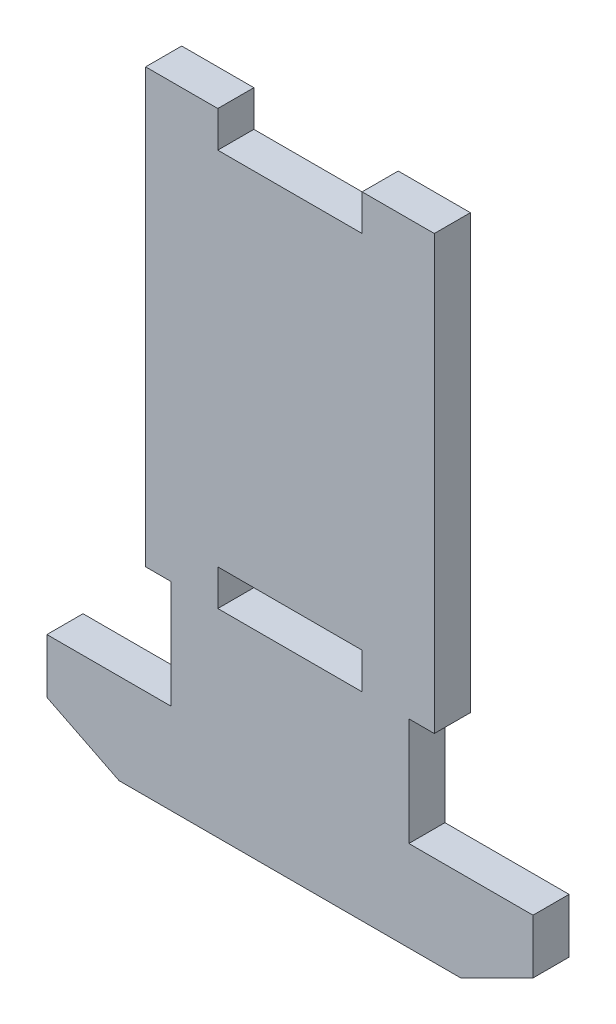
ISO-10303-21;
HEADER;
FILE_DESCRIPTION(('STEP AP214'),'2;1');
FILE_NAME('part.step','',(''),(''),'','','');
FILE_SCHEMA(('AUTOMOTIVE_DESIGN { 1 0 10303 214 1 1 1 1 }'));
ENDSEC;
DATA;
#1=APPLICATION_CONTEXT('core data for automotive mechanical design processes');
#2=APPLICATION_PROTOCOL_DEFINITION('international standard','automotive_design',2000,#1);
#3=PRODUCT_CONTEXT('',#1,'mechanical');
#4=PRODUCT('Part','Part','',(#3));
#5=PRODUCT_RELATED_PRODUCT_CATEGORY('part','',(#4));
#6=PRODUCT_DEFINITION_FORMATION('','',#4);
#7=PRODUCT_DEFINITION_CONTEXT('part definition',#1,'design');
#8=PRODUCT_DEFINITION('design','',#6,#7);
#9=PRODUCT_DEFINITION_SHAPE('','',#8);
#10=(LENGTH_UNIT() NAMED_UNIT(*) SI_UNIT(.MILLI.,.METRE.));
#11=(NAMED_UNIT(*) PLANE_ANGLE_UNIT() SI_UNIT($,.RADIAN.));
#12=(NAMED_UNIT(*) SI_UNIT($,.STERADIAN.) SOLID_ANGLE_UNIT());
#13=UNCERTAINTY_MEASURE_WITH_UNIT(LENGTH_MEASURE(1.E-05),#10,'distance_accuracy_value','');
#14=(GEOMETRIC_REPRESENTATION_CONTEXT(3) GLOBAL_UNCERTAINTY_ASSIGNED_CONTEXT((#13)) GLOBAL_UNIT_ASSIGNED_CONTEXT((#10,
#11,#12)) REPRESENTATION_CONTEXT('',''));
#15=CARTESIAN_POINT('',(0.,0.,0.));
#16=DIRECTION('',(0.,0.,1.));
#17=DIRECTION('',(1.,0.,0.));
#18=AXIS2_PLACEMENT_3D('',#15,#16,#17);
#19=CARTESIAN_POINT('',(12.7,-19.05,3.175));
#20=DIRECTION('',(0.,0.,-1.));
#21=DIRECTION('',(-1.,0.,0.));
#22=AXIS2_PLACEMENT_3D('',#19,#20,#21);
#23=PLANE('',#22);
#24=DIRECTION('',(0.,-1.,0.));
#25=VECTOR('',#24,1.);
#26=CARTESIAN_POINT('',(6.35,-19.05,3.175));
#27=LINE('',#26,#25);
#28=CARTESIAN_POINT('',(6.35,-15.875,3.175));
#29=VERTEX_POINT('',#28);
#30=CARTESIAN_POINT('',(6.35,-19.05,3.175));
#31=VERTEX_POINT('',#30);
#32=EDGE_CURVE('E305',#29,#31,#27,.T.);
#33=ORIENTED_EDGE('',*,*,#32,.T.);
#34=DIRECTION('',(1.,0.,0.));
#35=VECTOR('',#34,1.);
#36=CARTESIAN_POINT('',(12.7,-19.05,3.175));
#37=LINE('',#36,#35);
#38=CARTESIAN_POINT('',(-6.35,-19.05,3.175));
#39=VERTEX_POINT('',#38);
#40=EDGE_CURVE('E275',#39,#31,#37,.T.);
#41=ORIENTED_EDGE('',*,*,#40,.F.);
#42=DIRECTION('',(0.,1.,0.));
#43=VECTOR('',#42,1.);
#44=CARTESIAN_POINT('',(-6.35,-19.05,3.175));
#45=LINE('',#44,#43);
#46=CARTESIAN_POINT('',(-6.35,-15.875,3.175));
#47=VERTEX_POINT('',#46);
#48=EDGE_CURVE('E301',#39,#47,#45,.T.);
#49=ORIENTED_EDGE('',*,*,#48,.T.);
#50=DIRECTION('',(1.,0.,0.));
#51=VECTOR('',#50,1.);
#52=CARTESIAN_POINT('',(-6.35,-15.875,3.175));
#53=LINE('',#52,#51);
#54=EDGE_CURVE('E303',#47,#29,#53,.T.);
#55=ORIENTED_EDGE('',*,*,#54,.T.);
#56=EDGE_LOOP('',(#33,#41,#49,#55));
#57=FACE_BOUND('',#56,.T.);
#58=DIRECTION('',(0.894427190999916,-0.447213595499958,0.));
#59=VECTOR('',#58,1.);
#60=CARTESIAN_POINT('',(-21.38426,-33.3375,3.175));
#61=LINE('',#60,#59);
#62=CARTESIAN_POINT('',(-21.38426,-33.3375,3.175));
#63=VERTEX_POINT('',#62);
#64=CARTESIAN_POINT('',(-15.03426,-36.5125,3.175));
#65=VERTEX_POINT('',#64);
#66=EDGE_CURVE('E50',#63,#65,#61,.T.);
#67=ORIENTED_EDGE('',*,*,#66,.T.);
#68=DIRECTION('',(1.,0.,0.));
#69=VECTOR('',#68,1.);
#70=CARTESIAN_POINT('',(12.7,-36.5125,3.175));
#71=LINE('',#70,#69);
#72=CARTESIAN_POINT('',(15.03426,-36.5125,3.175));
#73=VERTEX_POINT('',#72);
#74=EDGE_CURVE('E278',#65,#73,#71,.T.);
#75=ORIENTED_EDGE('',*,*,#74,.T.);
#76=DIRECTION('',(-0.894427190999916,-0.447213595499958,0.));
#77=VECTOR('',#76,1.);
#78=CARTESIAN_POINT('',(21.38426,-33.3375,3.175));
#79=LINE('',#78,#77);
#80=CARTESIAN_POINT('',(21.38426,-33.3375,3.175));
#81=VERTEX_POINT('',#80);
#82=EDGE_CURVE('E233',#81,#73,#79,.T.);
#83=ORIENTED_EDGE('',*,*,#82,.F.);
#84=DIRECTION('',(0.,1.,0.));
#85=VECTOR('',#84,1.);
#86=CARTESIAN_POINT('',(21.38426,-28.55,3.175));
#87=LINE('',#86,#85);
#88=CARTESIAN_POINT('',(21.38426,-28.55,3.175));
#89=VERTEX_POINT('',#88);
#90=EDGE_CURVE('E244',#81,#89,#87,.T.);
#91=ORIENTED_EDGE('',*,*,#90,.T.);
#92=DIRECTION('',(1.,0.,0.));
#93=VECTOR('',#92,1.);
#94=CARTESIAN_POINT('',(12.7,-28.55,3.175));
#95=LINE('',#94,#93);
#96=CARTESIAN_POINT('',(10.461999904,-28.55,3.175));
#97=VERTEX_POINT('',#96);
#98=EDGE_CURVE('E269',#97,#89,#95,.T.);
#99=ORIENTED_EDGE('',*,*,#98,.F.);
#100=DIRECTION('',(0.,-1.,0.));
#101=VECTOR('',#100,1.);
#102=CARTESIAN_POINT('',(10.461999904,-19.05,3.175));
#103=LINE('',#102,#101);
#104=CARTESIAN_POINT('',(10.461999904,-19.05,3.175));
#105=VERTEX_POINT('',#104);
#106=EDGE_CURVE('E246',#105,#97,#103,.T.);
#107=ORIENTED_EDGE('',*,*,#106,.F.);
#108=DIRECTION('',(-1.,0.,0.));
#109=VECTOR('',#108,1.);
#110=CARTESIAN_POINT('',(12.7,-19.05,3.175));
#111=LINE('',#110,#109);
#112=CARTESIAN_POINT('',(12.7,-19.05,3.175));
#113=VERTEX_POINT('',#112);
#114=EDGE_CURVE('E254',#113,#105,#111,.T.);
#115=ORIENTED_EDGE('',*,*,#114,.F.);
#116=DIRECTION('',(0.,1.,0.));
#117=VECTOR('',#116,1.);
#118=CARTESIAN_POINT('',(12.7,19.05,3.175));
#119=LINE('',#118,#117);
#120=CARTESIAN_POINT('',(12.7,19.05,3.175));
#121=VERTEX_POINT('',#120);
#122=EDGE_CURVE('E285',#113,#121,#119,.T.);
#123=ORIENTED_EDGE('',*,*,#122,.T.);
#124=DIRECTION('',(-1.,0.,0.));
#125=VECTOR('',#124,1.);
#126=CARTESIAN_POINT('',(6.35,19.05,3.175));
#127=LINE('',#126,#125);
#128=CARTESIAN_POINT('',(6.35,19.05,3.175));
#129=VERTEX_POINT('',#128);
#130=EDGE_CURVE('E287',#121,#129,#127,.T.);
#131=ORIENTED_EDGE('',*,*,#130,.T.);
#132=DIRECTION('',(0.,-1.,0.));
#133=VECTOR('',#132,1.);
#134=CARTESIAN_POINT('',(6.35,19.05,3.175));
#135=LINE('',#134,#133);
#136=CARTESIAN_POINT('',(6.35,15.875,3.175));
#137=VERTEX_POINT('',#136);
#138=EDGE_CURVE('E290',#129,#137,#135,.T.);
#139=ORIENTED_EDGE('',*,*,#138,.T.);
#140=DIRECTION('',(-1.,0.,0.));
#141=VECTOR('',#140,1.);
#142=CARTESIAN_POINT('',(-6.35,15.875,3.175));
#143=LINE('',#142,#141);
#144=CARTESIAN_POINT('',(-6.35,15.875,3.175));
#145=VERTEX_POINT('',#144);
#146=EDGE_CURVE('E292',#137,#145,#143,.T.);
#147=ORIENTED_EDGE('',*,*,#146,.T.);
#148=DIRECTION('',(0.,1.,0.));
#149=VECTOR('',#148,1.);
#150=CARTESIAN_POINT('',(-6.35,19.05,3.175));
#151=LINE('',#150,#149);
#152=CARTESIAN_POINT('',(-6.35,19.05,3.175));
#153=VERTEX_POINT('',#152);
#154=EDGE_CURVE('E294',#145,#153,#151,.T.);
#155=ORIENTED_EDGE('',*,*,#154,.T.);
#156=DIRECTION('',(-1.,0.,0.));
#157=VECTOR('',#156,1.);
#158=CARTESIAN_POINT('',(-12.7,19.05,3.175));
#159=LINE('',#158,#157);
#160=CARTESIAN_POINT('',(-12.7,19.05,3.175));
#161=VERTEX_POINT('',#160);
#162=EDGE_CURVE('E296',#153,#161,#159,.T.);
#163=ORIENTED_EDGE('',*,*,#162,.T.);
#164=DIRECTION('',(0.,-1.,0.));
#165=VECTOR('',#164,1.);
#166=CARTESIAN_POINT('',(-12.7,19.05,3.175));
#167=LINE('',#166,#165);
#168=CARTESIAN_POINT('',(-12.7,-19.05,3.175));
#169=VERTEX_POINT('',#168);
#170=EDGE_CURVE('E298',#161,#169,#167,.T.);
#171=ORIENTED_EDGE('',*,*,#170,.T.);
#172=DIRECTION('',(1.,0.,0.));
#173=VECTOR('',#172,1.);
#174=CARTESIAN_POINT('',(-12.7,-19.05,3.175));
#175=LINE('',#174,#173);
#176=CARTESIAN_POINT('',(-10.461999904,-19.05,3.175));
#177=VERTEX_POINT('',#176);
#178=EDGE_CURVE('E227',#169,#177,#175,.T.);
#179=ORIENTED_EDGE('',*,*,#178,.T.);
#180=DIRECTION('',(0.,-1.,0.));
#181=VECTOR('',#180,1.);
#182=CARTESIAN_POINT('',(-10.461999904,-19.05,3.175));
#183=LINE('',#182,#181);
#184=CARTESIAN_POINT('',(-10.461999904,-28.55,3.175));
#185=VERTEX_POINT('',#184);
#186=EDGE_CURVE('E212',#177,#185,#183,.T.);
#187=ORIENTED_EDGE('',*,*,#186,.T.);
#188=DIRECTION('',(-1.,0.,0.));
#189=VECTOR('',#188,1.);
#190=CARTESIAN_POINT('',(-12.7,-28.55,3.175));
#191=LINE('',#190,#189);
#192=CARTESIAN_POINT('',(-21.38426,-28.55,3.175));
#193=VERTEX_POINT('',#192);
#194=EDGE_CURVE('E215',#185,#193,#191,.T.);
#195=ORIENTED_EDGE('',*,*,#194,.T.);
#196=DIRECTION('',(0.,1.,0.));
#197=VECTOR('',#196,1.);
#198=CARTESIAN_POINT('',(-21.38426,-28.55,3.175));
#199=LINE('',#198,#197);
#200=EDGE_CURVE('E207',#63,#193,#199,.T.);
#201=ORIENTED_EDGE('',*,*,#200,.F.);
#202=EDGE_LOOP('',(#67,#75,#83,#91,#99,#107,#115,#123,#131,#139,#147,#155,#163,#171,#179,#187,
#195,#201));
#203=FACE_BOUND('',#202,.T.);
#204=ADVANCED_FACE('F35',(#57,#203),#23,.F.);
#205=CARTESIAN_POINT('',(12.7,-19.05,0.));
#206=DIRECTION('',(0.,0.,-1.));
#207=DIRECTION('',(-1.,0.,0.));
#208=AXIS2_PLACEMENT_3D('',#205,#206,#207);
#209=PLANE('',#208);
#210=DIRECTION('',(-1.,0.,0.));
#211=VECTOR('',#210,1.);
#212=CARTESIAN_POINT('',(12.7,-19.05,0.));
#213=LINE('',#212,#211);
#214=CARTESIAN_POINT('',(6.35,-19.05,0.));
#215=VERTEX_POINT('',#214);
#216=CARTESIAN_POINT('',(-6.35,-19.05,0.));
#217=VERTEX_POINT('',#216);
#218=EDGE_CURVE('E279',#215,#217,#213,.T.);
#219=ORIENTED_EDGE('',*,*,#218,.F.);
#220=DIRECTION('',(0.,-1.,0.));
#221=VECTOR('',#220,1.);
#222=CARTESIAN_POINT('',(6.35,-19.05,0.));
#223=LINE('',#222,#221);
#224=CARTESIAN_POINT('',(6.35,-15.875,0.));
#225=VERTEX_POINT('',#224);
#226=EDGE_CURVE('E288',#225,#215,#223,.T.);
#227=ORIENTED_EDGE('',*,*,#226,.F.);
#228=DIRECTION('',(1.,0.,0.));
#229=VECTOR('',#228,1.);
#230=CARTESIAN_POINT('',(-6.35,-15.875,0.));
#231=LINE('',#230,#229);
#232=CARTESIAN_POINT('',(-6.35,-15.875,0.));
#233=VERTEX_POINT('',#232);
#234=EDGE_CURVE('E324',#233,#225,#231,.T.);
#235=ORIENTED_EDGE('',*,*,#234,.F.);
#236=DIRECTION('',(0.,1.,0.));
#237=VECTOR('',#236,1.);
#238=CARTESIAN_POINT('',(-6.35,-19.05,0.));
#239=LINE('',#238,#237);
#240=EDGE_CURVE('E322',#217,#233,#239,.T.);
#241=ORIENTED_EDGE('',*,*,#240,.F.);
#242=EDGE_LOOP('',(#219,#227,#235,#241));
#243=FACE_BOUND('',#242,.T.);
#244=DIRECTION('',(-1.,0.,0.));
#245=VECTOR('',#244,1.);
#246=CARTESIAN_POINT('',(12.7,-36.5125,0.));
#247=LINE('',#246,#245);
#248=CARTESIAN_POINT('',(15.03426,-36.5125,0.));
#249=VERTEX_POINT('',#248);
#250=CARTESIAN_POINT('',(-15.03426,-36.5125,0.));
#251=VERTEX_POINT('',#250);
#252=EDGE_CURVE('E200',#249,#251,#247,.T.);
#253=ORIENTED_EDGE('',*,*,#252,.T.);
#254=DIRECTION('',(-0.894427190999916,0.447213595499958,0.));
#255=VECTOR('',#254,1.);
#256=CARTESIAN_POINT('',(-21.38426,-33.3375,0.));
#257=LINE('',#256,#255);
#258=CARTESIAN_POINT('',(-21.38426,-33.3375,0.));
#259=VERTEX_POINT('',#258);
#260=EDGE_CURVE('E185',#251,#259,#257,.T.);
#261=ORIENTED_EDGE('',*,*,#260,.T.);
#262=DIRECTION('',(0.,-1.,0.));
#263=VECTOR('',#262,1.);
#264=CARTESIAN_POINT('',(-21.38426,-28.55,0.));
#265=LINE('',#264,#263);
#266=CARTESIAN_POINT('',(-21.38426,-28.55,0.));
#267=VERTEX_POINT('',#266);
#268=EDGE_CURVE('E197',#267,#259,#265,.T.);
#269=ORIENTED_EDGE('',*,*,#268,.F.);
#270=DIRECTION('',(1.,0.,0.));
#271=VECTOR('',#270,1.);
#272=CARTESIAN_POINT('',(-12.7,-28.55,0.));
#273=LINE('',#272,#271);
#274=CARTESIAN_POINT('',(-10.461999904,-28.55,0.));
#275=VERTEX_POINT('',#274);
#276=EDGE_CURVE('E223',#267,#275,#273,.T.);
#277=ORIENTED_EDGE('',*,*,#276,.T.);
#278=DIRECTION('',(0.,1.,0.));
#279=VECTOR('',#278,1.);
#280=CARTESIAN_POINT('',(-10.461999904,-19.05,0.));
#281=LINE('',#280,#279);
#282=CARTESIAN_POINT('',(-10.461999904,-19.05,0.));
#283=VERTEX_POINT('',#282);
#284=EDGE_CURVE('E220',#275,#283,#281,.T.);
#285=ORIENTED_EDGE('',*,*,#284,.T.);
#286=DIRECTION('',(-1.,0.,0.));
#287=VECTOR('',#286,1.);
#288=CARTESIAN_POINT('',(-12.7,-19.05,0.));
#289=LINE('',#288,#287);
#290=CARTESIAN_POINT('',(-12.7,-19.05,0.));
#291=VERTEX_POINT('',#290);
#292=EDGE_CURVE('E218',#283,#291,#289,.T.);
#293=ORIENTED_EDGE('',*,*,#292,.T.);
#294=DIRECTION('',(0.,-1.,0.));
#295=VECTOR('',#294,1.);
#296=CARTESIAN_POINT('',(-12.7,19.05,0.));
#297=LINE('',#296,#295);
#298=CARTESIAN_POINT('',(-12.7,19.05,0.));
#299=VERTEX_POINT('',#298);
#300=EDGE_CURVE('E319',#299,#291,#297,.T.);
#301=ORIENTED_EDGE('',*,*,#300,.F.);
#302=DIRECTION('',(-1.,0.,0.));
#303=VECTOR('',#302,1.);
#304=CARTESIAN_POINT('',(-12.7,19.05,0.));
#305=LINE('',#304,#303);
#306=CARTESIAN_POINT('',(-6.35,19.05,0.));
#307=VERTEX_POINT('',#306);
#308=EDGE_CURVE('E317',#307,#299,#305,.T.);
#309=ORIENTED_EDGE('',*,*,#308,.F.);
#310=DIRECTION('',(0.,1.,0.));
#311=VECTOR('',#310,1.);
#312=CARTESIAN_POINT('',(-6.35,19.05,0.));
#313=LINE('',#312,#311);
#314=CARTESIAN_POINT('',(-6.35,15.875,0.));
#315=VERTEX_POINT('',#314);
#316=EDGE_CURVE('E315',#315,#307,#313,.T.);
#317=ORIENTED_EDGE('',*,*,#316,.F.);
#318=DIRECTION('',(-1.,0.,0.));
#319=VECTOR('',#318,1.);
#320=CARTESIAN_POINT('',(-6.35,15.875,0.));
#321=LINE('',#320,#319);
#322=CARTESIAN_POINT('',(6.35,15.875,0.));
#323=VERTEX_POINT('',#322);
#324=EDGE_CURVE('E313',#323,#315,#321,.T.);
#325=ORIENTED_EDGE('',*,*,#324,.F.);
#326=DIRECTION('',(0.,-1.,0.));
#327=VECTOR('',#326,1.);
#328=CARTESIAN_POINT('',(6.35,19.05,0.));
#329=LINE('',#328,#327);
#330=CARTESIAN_POINT('',(6.35,19.05,0.));
#331=VERTEX_POINT('',#330);
#332=EDGE_CURVE('E311',#331,#323,#329,.T.);
#333=ORIENTED_EDGE('',*,*,#332,.F.);
#334=DIRECTION('',(-1.,0.,0.));
#335=VECTOR('',#334,1.);
#336=CARTESIAN_POINT('',(6.35,19.05,0.));
#337=LINE('',#336,#335);
#338=CARTESIAN_POINT('',(12.7,19.05,0.));
#339=VERTEX_POINT('',#338);
#340=EDGE_CURVE('E309',#339,#331,#337,.T.);
#341=ORIENTED_EDGE('',*,*,#340,.F.);
#342=DIRECTION('',(0.,1.,0.));
#343=VECTOR('',#342,1.);
#344=CARTESIAN_POINT('',(12.7,19.05,0.));
#345=LINE('',#344,#343);
#346=CARTESIAN_POINT('',(12.7,-19.05,0.));
#347=VERTEX_POINT('',#346);
#348=EDGE_CURVE('E284',#347,#339,#345,.T.);
#349=ORIENTED_EDGE('',*,*,#348,.F.);
#350=DIRECTION('',(1.,0.,0.));
#351=VECTOR('',#350,1.);
#352=CARTESIAN_POINT('',(12.7,-19.05,0.));
#353=LINE('',#352,#351);
#354=CARTESIAN_POINT('',(10.461999904,-19.05,0.));
#355=VERTEX_POINT('',#354);
#356=EDGE_CURVE('E263',#355,#347,#353,.T.);
#357=ORIENTED_EDGE('',*,*,#356,.F.);
#358=DIRECTION('',(0.,1.,0.));
#359=VECTOR('',#358,1.);
#360=CARTESIAN_POINT('',(10.461999904,-19.05,0.));
#361=LINE('',#360,#359);
#362=CARTESIAN_POINT('',(10.461999904,-28.55,0.));
#363=VERTEX_POINT('',#362);
#364=EDGE_CURVE('E260',#363,#355,#361,.T.);
#365=ORIENTED_EDGE('',*,*,#364,.F.);
#366=DIRECTION('',(-1.,0.,0.));
#367=VECTOR('',#366,1.);
#368=CARTESIAN_POINT('',(12.7,-28.55,0.));
#369=LINE('',#368,#367);
#370=CARTESIAN_POINT('',(21.38426,-28.55,0.));
#371=VERTEX_POINT('',#370);
#372=EDGE_CURVE('E257',#371,#363,#369,.T.);
#373=ORIENTED_EDGE('',*,*,#372,.F.);
#374=DIRECTION('',(0.,-1.,0.));
#375=VECTOR('',#374,1.);
#376=CARTESIAN_POINT('',(21.38426,-28.55,0.));
#377=LINE('',#376,#375);
#378=CARTESIAN_POINT('',(21.38426,-33.3375,0.));
#379=VERTEX_POINT('',#378);
#380=EDGE_CURVE('E242',#371,#379,#377,.T.);
#381=ORIENTED_EDGE('',*,*,#380,.T.);
#382=DIRECTION('',(0.894427190999916,0.447213595499958,0.));
#383=VECTOR('',#382,1.);
#384=CARTESIAN_POINT('',(21.38426,-33.3375,0.));
#385=LINE('',#384,#383);
#386=EDGE_CURVE('E236',#249,#379,#385,.T.);
#387=ORIENTED_EDGE('',*,*,#386,.F.);
#388=EDGE_LOOP('',(#253,#261,#269,#277,#285,#293,#301,#309,#317,#325,#333,#341,#349,#357,#365,
#373,#381,#387));
#389=FACE_BOUND('',#388,.T.);
#390=ADVANCED_FACE('F195',(#243,#389),#209,.T.);
#391=CARTESIAN_POINT('',(12.7,-36.5125,33.9986744443293));
#392=DIRECTION('',(0.,-1.,0.));
#393=DIRECTION('',(0.,0.,-1.));
#394=AXIS2_PLACEMENT_3D('',#391,#392,#393);
#395=PLANE('',#394);
#396=ORIENTED_EDGE('',*,*,#74,.F.);
#397=DIRECTION('',(0.,0.,-1.));
#398=VECTOR('',#397,1.);
#399=CARTESIAN_POINT('',(-15.03426,-36.5125,3.176));
#400=LINE('',#399,#398);
#401=EDGE_CURVE('E190',#65,#251,#400,.T.);
#402=ORIENTED_EDGE('',*,*,#401,.T.);
#403=ORIENTED_EDGE('',*,*,#252,.F.);
#404=DIRECTION('',(0.,0.,-1.));
#405=VECTOR('',#404,1.);
#406=CARTESIAN_POINT('',(15.03426,-36.5125,3.176));
#407=LINE('',#406,#405);
#408=EDGE_CURVE('E238',#73,#249,#407,.T.);
#409=ORIENTED_EDGE('',*,*,#408,.F.);
#410=EDGE_LOOP('',(#396,#402,#403,#409));
#411=FACE_BOUND('',#410,.T.);
#412=ADVANCED_FACE('F400',(#411),#395,.T.);
#413=CARTESIAN_POINT('',(-21.38426,-28.55,14.9570956538979));
#414=DIRECTION('',(1.,0.,0.));
#415=DIRECTION('',(0.,0.,-1.));
#416=AXIS2_PLACEMENT_3D('',#413,#414,#415);
#417=PLANE('',#416);
#418=DIRECTION('',(0.,0.,-1.));
#419=VECTOR('',#418,1.);
#420=CARTESIAN_POINT('',(-21.38426,-33.3375,3.176));
#421=LINE('',#420,#419);
#422=EDGE_CURVE('E182',#63,#259,#421,.T.);
#423=ORIENTED_EDGE('',*,*,#422,.F.);
#424=ORIENTED_EDGE('',*,*,#200,.T.);
#425=DIRECTION('',(0.,0.,-1.));
#426=VECTOR('',#425,1.);
#427=CARTESIAN_POINT('',(-21.38426,-28.55,14.9570956538979));
#428=LINE('',#427,#426);
#429=EDGE_CURVE('E205',#193,#267,#428,.T.);
#430=ORIENTED_EDGE('',*,*,#429,.T.);
#431=ORIENTED_EDGE('',*,*,#268,.T.);
#432=EDGE_LOOP('',(#423,#424,#430,#431));
#433=FACE_BOUND('',#432,.T.);
#434=ADVANCED_FACE('F203',(#433),#417,.F.);
#435=CARTESIAN_POINT('',(-12.7,19.05,3.175));
#436=DIRECTION('',(1.,0.,0.));
#437=DIRECTION('',(0.,0.,-1.));
#438=AXIS2_PLACEMENT_3D('',#435,#436,#437);
#439=PLANE('',#438);
#440=DIRECTION('',(0.,0.,-1.));
#441=VECTOR('',#440,1.);
#442=CARTESIAN_POINT('',(-12.7,-19.05,3.176));
#443=LINE('',#442,#441);
#444=EDGE_CURVE('E58',#169,#291,#443,.T.);
#445=ORIENTED_EDGE('',*,*,#444,.F.);
#446=ORIENTED_EDGE('',*,*,#170,.F.);
#447=DIRECTION('',(0.,0.,-1.));
#448=VECTOR('',#447,1.);
#449=CARTESIAN_POINT('',(-12.7,19.05,3.175));
#450=LINE('',#449,#448);
#451=EDGE_CURVE('E338',#161,#299,#450,.T.);
#452=ORIENTED_EDGE('',*,*,#451,.T.);
#453=ORIENTED_EDGE('',*,*,#300,.T.);
#454=EDGE_LOOP('',(#445,#446,#452,#453));
#455=FACE_BOUND('',#454,.T.);
#456=ADVANCED_FACE('F408',(#455),#439,.F.);
#457=CARTESIAN_POINT('',(12.7,19.05,3.175));
#458=DIRECTION('',(-1.,0.,0.));
#459=DIRECTION('',(0.,0.,1.));
#460=AXIS2_PLACEMENT_3D('',#457,#458,#459);
#461=PLANE('',#460);
#462=ORIENTED_EDGE('',*,*,#122,.F.);
#463=DIRECTION('',(0.,0.,-1.));
#464=VECTOR('',#463,1.);
#465=CARTESIAN_POINT('',(12.7,-19.05,3.176));
#466=LINE('',#465,#464);
#467=EDGE_CURVE('E266',#113,#347,#466,.T.);
#468=ORIENTED_EDGE('',*,*,#467,.T.);
#469=ORIENTED_EDGE('',*,*,#348,.T.);
#470=DIRECTION('',(0.,0.,-1.));
#471=VECTOR('',#470,1.);
#472=CARTESIAN_POINT('',(12.7,19.05,3.175));
#473=LINE('',#472,#471);
#474=EDGE_CURVE('E11',#121,#339,#473,.T.);
#475=ORIENTED_EDGE('',*,*,#474,.F.);
#476=EDGE_LOOP('',(#462,#468,#469,#475));
#477=FACE_BOUND('',#476,.T.);
#478=ADVANCED_FACE('F37',(#477),#461,.F.);
#479=CARTESIAN_POINT('',(6.35,19.05,3.175));
#480=DIRECTION('',(0.,-1.,0.));
#481=DIRECTION('',(0.,0.,-1.));
#482=AXIS2_PLACEMENT_3D('',#479,#480,#481);
#483=PLANE('',#482);
#484=ORIENTED_EDGE('',*,*,#340,.T.);
#485=DIRECTION('',(0.,0.,-1.));
#486=VECTOR('',#485,1.);
#487=CARTESIAN_POINT('',(6.35,19.05,3.175));
#488=LINE('',#487,#486);
#489=EDGE_CURVE('E43',#129,#331,#488,.T.);
#490=ORIENTED_EDGE('',*,*,#489,.F.);
#491=ORIENTED_EDGE('',*,*,#130,.F.);
#492=ORIENTED_EDGE('',*,*,#474,.T.);
#493=EDGE_LOOP('',(#484,#490,#491,#492));
#494=FACE_BOUND('',#493,.T.);
#495=ADVANCED_FACE('F377',(#494),#483,.F.);
#496=CARTESIAN_POINT('',(6.35,19.05,3.175));
#497=DIRECTION('',(1.,0.,0.));
#498=DIRECTION('',(0.,1.,0.));
#499=AXIS2_PLACEMENT_3D('',#496,#497,#498);
#500=PLANE('',#499);
#501=ORIENTED_EDGE('',*,*,#332,.T.);
#502=DIRECTION('',(0.,0.,-1.));
#503=VECTOR('',#502,1.);
#504=CARTESIAN_POINT('',(6.35,15.875,3.175));
#505=LINE('',#504,#503);
#506=EDGE_CURVE('E347',#137,#323,#505,.T.);
#507=ORIENTED_EDGE('',*,*,#506,.F.);
#508=ORIENTED_EDGE('',*,*,#138,.F.);
#509=ORIENTED_EDGE('',*,*,#489,.T.);
#510=EDGE_LOOP('',(#501,#507,#508,#509));
#511=FACE_BOUND('',#510,.T.);
#512=ADVANCED_FACE('F354',(#511),#500,.F.);
#513=CARTESIAN_POINT('',(-6.35,15.875,3.175));
#514=DIRECTION('',(0.,-1.,0.));
#515=DIRECTION('',(0.,0.,-1.));
#516=AXIS2_PLACEMENT_3D('',#513,#514,#515);
#517=PLANE('',#516);
#518=ORIENTED_EDGE('',*,*,#324,.T.);
#519=DIRECTION('',(0.,0.,-1.));
#520=VECTOR('',#519,1.);
#521=CARTESIAN_POINT('',(-6.35,15.875,3.175));
#522=LINE('',#521,#520);
#523=EDGE_CURVE('E344',#145,#315,#522,.T.);
#524=ORIENTED_EDGE('',*,*,#523,.F.);
#525=ORIENTED_EDGE('',*,*,#146,.F.);
#526=ORIENTED_EDGE('',*,*,#506,.T.);
#527=EDGE_LOOP('',(#518,#524,#525,#526));
#528=FACE_BOUND('',#527,.T.);
#529=ADVANCED_FACE('F365',(#528),#517,.F.);
#530=CARTESIAN_POINT('',(-6.35,19.05,3.175));
#531=DIRECTION('',(-1.,0.,0.));
#532=DIRECTION('',(0.,0.,1.));
#533=AXIS2_PLACEMENT_3D('',#530,#531,#532);
#534=PLANE('',#533);
#535=ORIENTED_EDGE('',*,*,#316,.T.);
#536=DIRECTION('',(0.,0.,-1.));
#537=VECTOR('',#536,1.);
#538=CARTESIAN_POINT('',(-6.35,19.05,3.175));
#539=LINE('',#538,#537);
#540=EDGE_CURVE('E341',#153,#307,#539,.T.);
#541=ORIENTED_EDGE('',*,*,#540,.F.);
#542=ORIENTED_EDGE('',*,*,#154,.F.);
#543=ORIENTED_EDGE('',*,*,#523,.T.);
#544=EDGE_LOOP('',(#535,#541,#542,#543));
#545=FACE_BOUND('',#544,.T.);
#546=ADVANCED_FACE('F369',(#545),#534,.F.);
#547=CARTESIAN_POINT('',(-12.7,19.05,3.175));
#548=DIRECTION('',(0.,-1.,0.));
#549=DIRECTION('',(0.,0.,-1.));
#550=AXIS2_PLACEMENT_3D('',#547,#548,#549);
#551=PLANE('',#550);
#552=ORIENTED_EDGE('',*,*,#308,.T.);
#553=ORIENTED_EDGE('',*,*,#451,.F.);
#554=ORIENTED_EDGE('',*,*,#162,.F.);
#555=ORIENTED_EDGE('',*,*,#540,.T.);
#556=EDGE_LOOP('',(#552,#553,#554,#555));
#557=FACE_BOUND('',#556,.T.);
#558=ADVANCED_FACE('F431',(#557),#551,.F.);
#559=CARTESIAN_POINT('',(-6.35,-19.05,3.175));
#560=DIRECTION('',(-1.,0.,0.));
#561=DIRECTION('',(0.,-1.,0.));
#562=AXIS2_PLACEMENT_3D('',#559,#560,#561);
#563=PLANE('',#562);
#564=ORIENTED_EDGE('',*,*,#240,.T.);
#565=DIRECTION('',(0.,0.,-1.));
#566=VECTOR('',#565,1.);
#567=CARTESIAN_POINT('',(-6.35,-15.875,3.175));
#568=LINE('',#567,#566);
#569=EDGE_CURVE('E332',#47,#233,#568,.T.);
#570=ORIENTED_EDGE('',*,*,#569,.F.);
#571=ORIENTED_EDGE('',*,*,#48,.F.);
#572=DIRECTION('',(0.,0.,-1.));
#573=VECTOR('',#572,1.);
#574=CARTESIAN_POINT('',(-6.35,-19.05,3.175));
#575=LINE('',#574,#573);
#576=EDGE_CURVE('E335',#39,#217,#575,.T.);
#577=ORIENTED_EDGE('',*,*,#576,.T.);
#578=EDGE_LOOP('',(#564,#570,#571,#577));
#579=FACE_BOUND('',#578,.T.);
#580=ADVANCED_FACE('F427',(#579),#563,.F.);
#581=CARTESIAN_POINT('',(-6.35,-15.875,3.175));
#582=DIRECTION('',(0.,1.,0.));
#583=DIRECTION('',(0.,0.,1.));
#584=AXIS2_PLACEMENT_3D('',#581,#582,#583);
#585=PLANE('',#584);
#586=ORIENTED_EDGE('',*,*,#234,.T.);
#587=DIRECTION('',(0.,0.,-1.));
#588=VECTOR('',#587,1.);
#589=CARTESIAN_POINT('',(6.35,-15.875,3.175));
#590=LINE('',#589,#588);
#591=EDGE_CURVE('E329',#29,#225,#590,.T.);
#592=ORIENTED_EDGE('',*,*,#591,.F.);
#593=ORIENTED_EDGE('',*,*,#54,.F.);
#594=ORIENTED_EDGE('',*,*,#569,.T.);
#595=EDGE_LOOP('',(#586,#592,#593,#594));
#596=FACE_BOUND('',#595,.T.);
#597=ADVANCED_FACE('F423',(#596),#585,.F.);
#598=CARTESIAN_POINT('',(6.35,-19.05,3.175));
#599=DIRECTION('',(1.,0.,0.));
#600=DIRECTION('',(0.,1.,0.));
#601=AXIS2_PLACEMENT_3D('',#598,#599,#600);
#602=PLANE('',#601);
#603=ORIENTED_EDGE('',*,*,#226,.T.);
#604=DIRECTION('',(0.,0.,-1.));
#605=VECTOR('',#604,1.);
#606=CARTESIAN_POINT('',(6.35,-19.05,3.175));
#607=LINE('',#606,#605);
#608=EDGE_CURVE('E307',#31,#215,#607,.T.);
#609=ORIENTED_EDGE('',*,*,#608,.F.);
#610=ORIENTED_EDGE('',*,*,#32,.F.);
#611=ORIENTED_EDGE('',*,*,#591,.T.);
#612=EDGE_LOOP('',(#603,#609,#610,#611));
#613=FACE_BOUND('',#612,.T.);
#614=ADVANCED_FACE('F419',(#613),#602,.F.);
#615=CARTESIAN_POINT('',(12.7,-19.05,33.9986744443293));
#616=DIRECTION('',(0.,-1.,0.));
#617=DIRECTION('',(0.,0.,-1.));
#618=AXIS2_PLACEMENT_3D('',#615,#616,#617);
#619=PLANE('',#618);
#620=ORIENTED_EDGE('',*,*,#218,.T.);
#621=ORIENTED_EDGE('',*,*,#576,.F.);
#622=ORIENTED_EDGE('',*,*,#40,.T.);
#623=ORIENTED_EDGE('',*,*,#608,.T.);
#624=EDGE_LOOP('',(#620,#621,#622,#623));
#625=FACE_BOUND('',#624,.T.);
#626=ADVANCED_FACE('F422',(#625),#619,.F.);
#627=CARTESIAN_POINT('',(12.7,-19.05,3.176));
#628=DIRECTION('',(0.,1.,0.));
#629=DIRECTION('',(0.,0.,1.));
#630=AXIS2_PLACEMENT_3D('',#627,#628,#629);
#631=PLANE('',#630);
#632=ORIENTED_EDGE('',*,*,#114,.T.);
#633=DIRECTION('',(0.,0.,-1.));
#634=VECTOR('',#633,1.);
#635=CARTESIAN_POINT('',(10.461999904,-19.05,3.176));
#636=LINE('',#635,#634);
#637=EDGE_CURVE('E270',#105,#355,#636,.T.);
#638=ORIENTED_EDGE('',*,*,#637,.T.);
#639=ORIENTED_EDGE('',*,*,#356,.T.);
#640=ORIENTED_EDGE('',*,*,#467,.F.);
#641=EDGE_LOOP('',(#632,#638,#639,#640));
#642=FACE_BOUND('',#641,.T.);
#643=ADVANCED_FACE('F382',(#642),#631,.F.);
#644=CARTESIAN_POINT('',(10.461999904,-19.05,3.176));
#645=DIRECTION('',(-1.,0.,0.));
#646=DIRECTION('',(0.,-1.,0.));
#647=AXIS2_PLACEMENT_3D('',#644,#645,#646);
#648=PLANE('',#647);
#649=ORIENTED_EDGE('',*,*,#106,.T.);
#650=DIRECTION('',(0.,0.,-1.));
#651=VECTOR('',#650,1.);
#652=CARTESIAN_POINT('',(10.461999904,-28.55,3.176));
#653=LINE('',#652,#651);
#654=EDGE_CURVE('E265',#97,#363,#653,.T.);
#655=ORIENTED_EDGE('',*,*,#654,.T.);
#656=ORIENTED_EDGE('',*,*,#364,.T.);
#657=ORIENTED_EDGE('',*,*,#637,.F.);
#658=EDGE_LOOP('',(#649,#655,#656,#657));
#659=FACE_BOUND('',#658,.T.);
#660=ADVANCED_FACE('F385',(#659),#648,.F.);
#661=CARTESIAN_POINT('',(12.7,-28.55,3.176));
#662=DIRECTION('',(0.,-1.,0.));
#663=DIRECTION('',(0.,0.,-1.));
#664=AXIS2_PLACEMENT_3D('',#661,#662,#663);
#665=PLANE('',#664);
#666=ORIENTED_EDGE('',*,*,#98,.T.);
#667=DIRECTION('',(0.,0.,-1.));
#668=VECTOR('',#667,1.);
#669=CARTESIAN_POINT('',(21.38426,-28.55,14.9570956538979));
#670=LINE('',#669,#668);
#671=EDGE_CURVE('E247',#89,#371,#670,.T.);
#672=ORIENTED_EDGE('',*,*,#671,.T.);
#673=ORIENTED_EDGE('',*,*,#372,.T.);
#674=ORIENTED_EDGE('',*,*,#654,.F.);
#675=EDGE_LOOP('',(#666,#672,#673,#674));
#676=FACE_BOUND('',#675,.T.);
#677=ADVANCED_FACE('F388',(#676),#665,.F.);
#678=CARTESIAN_POINT('',(21.38426,-28.55,14.9570956538979));
#679=DIRECTION('',(1.,0.,0.));
#680=DIRECTION('',(0.,0.,-1.));
#681=AXIS2_PLACEMENT_3D('',#678,#679,#680);
#682=PLANE('',#681);
#683=DIRECTION('',(0.,0.,-1.));
#684=VECTOR('',#683,1.);
#685=CARTESIAN_POINT('',(21.38426,-33.3375,3.176));
#686=LINE('',#685,#684);
#687=EDGE_CURVE('E239',#81,#379,#686,.T.);
#688=ORIENTED_EDGE('',*,*,#687,.T.);
#689=ORIENTED_EDGE('',*,*,#380,.F.);
#690=ORIENTED_EDGE('',*,*,#671,.F.);
#691=ORIENTED_EDGE('',*,*,#90,.F.);
#692=EDGE_LOOP('',(#688,#689,#690,#691));
#693=FACE_BOUND('',#692,.T.);
#694=ADVANCED_FACE('F392',(#693),#682,.T.);
#695=CARTESIAN_POINT('',(21.38426,-33.3375,3.176));
#696=DIRECTION('',(-0.447213595499958,0.894427190999916,0.));
#697=DIRECTION('',(-0.894427190999916,-0.447213595499958,0.));
#698=AXIS2_PLACEMENT_3D('',#695,#696,#697);
#699=PLANE('',#698);
#700=ORIENTED_EDGE('',*,*,#82,.T.);
#701=ORIENTED_EDGE('',*,*,#408,.T.);
#702=ORIENTED_EDGE('',*,*,#386,.T.);
#703=ORIENTED_EDGE('',*,*,#687,.F.);
#704=EDGE_LOOP('',(#700,#701,#702,#703));
#705=FACE_BOUND('',#704,.T.);
#706=ADVANCED_FACE('F396',(#705),#699,.F.);
#707=CARTESIAN_POINT('',(-12.7,-28.55,3.176));
#708=DIRECTION('',(0.,1.,0.));
#709=DIRECTION('',(0.,0.,1.));
#710=AXIS2_PLACEMENT_3D('',#707,#708,#709);
#711=PLANE('',#710);
#712=DIRECTION('',(0.,0.,-1.));
#713=VECTOR('',#712,1.);
#714=CARTESIAN_POINT('',(-10.461999904,-28.55,3.176));
#715=LINE('',#714,#713);
#716=EDGE_CURVE('E225',#185,#275,#715,.T.);
#717=ORIENTED_EDGE('',*,*,#716,.T.);
#718=ORIENTED_EDGE('',*,*,#276,.F.);
#719=ORIENTED_EDGE('',*,*,#429,.F.);
#720=ORIENTED_EDGE('',*,*,#194,.F.);
#721=EDGE_LOOP('',(#717,#718,#719,#720));
#722=FACE_BOUND('',#721,.T.);
#723=ADVANCED_FACE('F492',(#722),#711,.T.);
#724=CARTESIAN_POINT('',(-10.461999904,-19.05,3.176));
#725=DIRECTION('',(-1.,0.,0.));
#726=DIRECTION('',(0.,-1.,0.));
#727=AXIS2_PLACEMENT_3D('',#724,#725,#726);
#728=PLANE('',#727);
#729=DIRECTION('',(0.,0.,-1.));
#730=VECTOR('',#729,1.);
#731=CARTESIAN_POINT('',(-10.461999904,-19.05,3.176));
#732=LINE('',#731,#730);
#733=EDGE_CURVE('E228',#177,#283,#732,.T.);
#734=ORIENTED_EDGE('',*,*,#733,.T.);
#735=ORIENTED_EDGE('',*,*,#284,.F.);
#736=ORIENTED_EDGE('',*,*,#716,.F.);
#737=ORIENTED_EDGE('',*,*,#186,.F.);
#738=EDGE_LOOP('',(#734,#735,#736,#737));
#739=FACE_BOUND('',#738,.T.);
#740=ADVANCED_FACE('F592',(#739),#728,.T.);
#741=CARTESIAN_POINT('',(-12.7,-19.05,3.176));
#742=DIRECTION('',(0.,-1.,0.));
#743=DIRECTION('',(0.,0.,-1.));
#744=AXIS2_PLACEMENT_3D('',#741,#742,#743);
#745=PLANE('',#744);
#746=ORIENTED_EDGE('',*,*,#444,.T.);
#747=ORIENTED_EDGE('',*,*,#292,.F.);
#748=ORIENTED_EDGE('',*,*,#733,.F.);
#749=ORIENTED_EDGE('',*,*,#178,.F.);
#750=EDGE_LOOP('',(#746,#747,#748,#749));
#751=FACE_BOUND('',#750,.T.);
#752=ADVANCED_FACE('F589',(#751),#745,.T.);
#753=CARTESIAN_POINT('',(-21.38426,-33.3375,3.176));
#754=DIRECTION('',(-0.447213595499958,-0.894427190999916,0.));
#755=DIRECTION('',(0.894427190999916,-0.447213595499958,0.));
#756=AXIS2_PLACEMENT_3D('',#753,#754,#755);
#757=PLANE('',#756);
#758=ORIENTED_EDGE('',*,*,#422,.T.);
#759=ORIENTED_EDGE('',*,*,#260,.F.);
#760=ORIENTED_EDGE('',*,*,#401,.F.);
#761=ORIENTED_EDGE('',*,*,#66,.F.);
#762=EDGE_LOOP('',(#758,#759,#760,#761));
#763=FACE_BOUND('',#762,.T.);
#764=ADVANCED_FACE('F184',(#763),#757,.T.);
#765=CLOSED_SHELL('',(#204,#390,#412,#434,#456,#478,#495,#512,#529,#546,#558,#580,#597,#614,
#626,#643,#660,#677,#694,#706,#723,#740,#752,#764));
#766=MANIFOLD_SOLID_BREP('B2',#765);
#767=ADVANCED_BREP_SHAPE_REPRESENTATION('',(#18,#766),#14);
#768=SHAPE_DEFINITION_REPRESENTATION(#9,#767);
ENDSEC;
END-ISO-10303-21;
